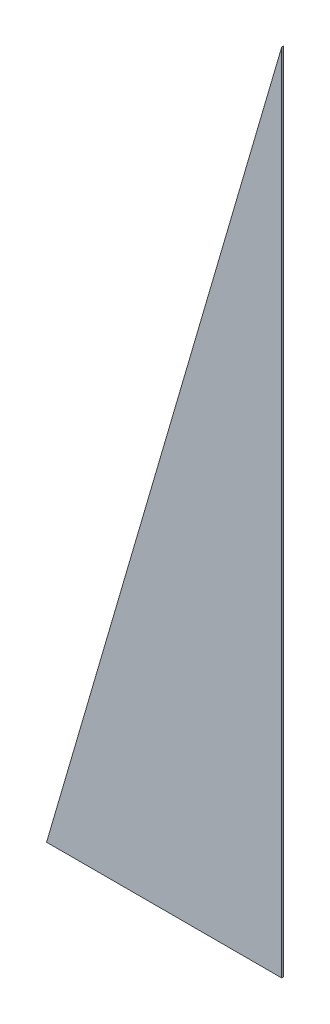
ISO-10303-21;
HEADER;
FILE_DESCRIPTION(('STEP AP214'),'2;1');
FILE_NAME('part.step','',(''),(''),'','','');
FILE_SCHEMA(('AUTOMOTIVE_DESIGN { 1 0 10303 214 1 1 1 1 }'));
ENDSEC;
DATA;
#1=APPLICATION_CONTEXT('core data for automotive mechanical design processes');
#2=APPLICATION_PROTOCOL_DEFINITION('international standard','automotive_design',2000,#1);
#3=PRODUCT_CONTEXT('',#1,'mechanical');
#4=PRODUCT('Part','Part','',(#3));
#5=PRODUCT_RELATED_PRODUCT_CATEGORY('part','',(#4));
#6=PRODUCT_DEFINITION_FORMATION('','',#4);
#7=PRODUCT_DEFINITION_CONTEXT('part definition',#1,'design');
#8=PRODUCT_DEFINITION('design','',#6,#7);
#9=PRODUCT_DEFINITION_SHAPE('','',#8);
#10=(LENGTH_UNIT() NAMED_UNIT(*) SI_UNIT(.MILLI.,.METRE.));
#11=(NAMED_UNIT(*) PLANE_ANGLE_UNIT() SI_UNIT($,.RADIAN.));
#12=(NAMED_UNIT(*) SI_UNIT($,.STERADIAN.) SOLID_ANGLE_UNIT());
#13=UNCERTAINTY_MEASURE_WITH_UNIT(LENGTH_MEASURE(1.E-05),#10,'distance_accuracy_value','');
#14=(GEOMETRIC_REPRESENTATION_CONTEXT(3) GLOBAL_UNCERTAINTY_ASSIGNED_CONTEXT((#13)) GLOBAL_UNIT_ASSIGNED_CONTEXT((#10,
#11,#12)) REPRESENTATION_CONTEXT('',''));
#15=CARTESIAN_POINT('',(0.,0.,0.));
#16=DIRECTION('',(0.,0.,1.));
#17=DIRECTION('',(1.,0.,0.));
#18=AXIS2_PLACEMENT_3D('',#15,#16,#17);
#19=CARTESIAN_POINT('',(-355.6,0.,2.54));
#20=DIRECTION('',(0.,1.,0.));
#21=DIRECTION('',(0.,0.,1.));
#22=AXIS2_PLACEMENT_3D('',#19,#20,#21);
#23=PLANE('',#22);
#24=DIRECTION('',(1.,0.,0.));
#25=VECTOR('',#24,1.);
#26=CARTESIAN_POINT('',(-355.6,0.,0.));
#27=LINE('',#26,#25);
#28=CARTESIAN_POINT('',(-355.6,0.,0.));
#29=VERTEX_POINT('',#28);
#30=CARTESIAN_POINT('',(0.,0.,0.));
#31=VERTEX_POINT('',#30);
#32=EDGE_CURVE('E82',#29,#31,#27,.T.);
#33=ORIENTED_EDGE('',*,*,#32,.T.);
#34=DIRECTION('',(0.,0.,-1.));
#35=VECTOR('',#34,1.);
#36=CARTESIAN_POINT('',(0.,0.,2.54));
#37=LINE('',#36,#35);
#38=CARTESIAN_POINT('',(0.,0.,2.54));
#39=VERTEX_POINT('',#38);
#40=EDGE_CURVE('E11',#39,#31,#37,.T.);
#41=ORIENTED_EDGE('',*,*,#40,.F.);
#42=DIRECTION('',(1.,0.,0.));
#43=VECTOR('',#42,1.);
#44=CARTESIAN_POINT('',(-355.6,0.,2.54));
#45=LINE('',#44,#43);
#46=CARTESIAN_POINT('',(-355.6,0.,2.54));
#47=VERTEX_POINT('',#46);
#48=EDGE_CURVE('E75',#47,#39,#45,.T.);
#49=ORIENTED_EDGE('',*,*,#48,.F.);
#50=DIRECTION('',(0.,0.,-1.));
#51=VECTOR('',#50,1.);
#52=CARTESIAN_POINT('',(-355.6,0.,2.54));
#53=LINE('',#52,#51);
#54=EDGE_CURVE('E83',#47,#29,#53,.T.);
#55=ORIENTED_EDGE('',*,*,#54,.T.);
#56=EDGE_LOOP('',(#33,#41,#49,#55));
#57=FACE_BOUND('',#56,.T.);
#58=ADVANCED_FACE('F35',(#57),#23,.F.);
#59=CARTESIAN_POINT('',(0.,0.,2.54));
#60=DIRECTION('',(-1.,0.,0.));
#61=DIRECTION('',(0.,0.,1.));
#62=AXIS2_PLACEMENT_3D('',#59,#60,#61);
#63=PLANE('',#62);
#64=DIRECTION('',(0.,1.,0.));
#65=VECTOR('',#64,1.);
#66=CARTESIAN_POINT('',(0.,0.,0.));
#67=LINE('',#66,#65);
#68=CARTESIAN_POINT('',(0.,1219.2,0.));
#69=VERTEX_POINT('',#68);
#70=EDGE_CURVE('E63',#31,#69,#67,.T.);
#71=ORIENTED_EDGE('',*,*,#70,.T.);
#72=DIRECTION('',(0.,0.,-1.));
#73=VECTOR('',#72,1.);
#74=CARTESIAN_POINT('',(0.,1219.2,2.54));
#75=LINE('',#74,#73);
#76=CARTESIAN_POINT('',(0.,1219.2,2.54));
#77=VERTEX_POINT('',#76);
#78=EDGE_CURVE('E43',#77,#69,#75,.T.);
#79=ORIENTED_EDGE('',*,*,#78,.F.);
#80=DIRECTION('',(0.,1.,0.));
#81=VECTOR('',#80,1.);
#82=CARTESIAN_POINT('',(0.,0.,2.54));
#83=LINE('',#82,#81);
#84=EDGE_CURVE('E71',#39,#77,#83,.T.);
#85=ORIENTED_EDGE('',*,*,#84,.F.);
#86=ORIENTED_EDGE('',*,*,#40,.T.);
#87=EDGE_LOOP('',(#71,#79,#85,#86));
#88=FACE_BOUND('',#87,.T.);
#89=ADVANCED_FACE('F72',(#88),#63,.F.);
#90=CARTESIAN_POINT('',(0.,1219.2,2.54));
#91=DIRECTION('',(0.96,-0.28,0.));
#92=DIRECTION('',(0.28,0.96,0.));
#93=AXIS2_PLACEMENT_3D('',#90,#91,#92);
#94=PLANE('',#93);
#95=DIRECTION('',(-0.28,-0.96,0.));
#96=VECTOR('',#95,1.);
#97=CARTESIAN_POINT('',(0.,1219.2,0.));
#98=LINE('',#97,#96);
#99=EDGE_CURVE('E68',#69,#29,#98,.T.);
#100=ORIENTED_EDGE('',*,*,#99,.T.);
#101=ORIENTED_EDGE('',*,*,#54,.F.);
#102=DIRECTION('',(-0.28,-0.96,0.));
#103=VECTOR('',#102,1.);
#104=CARTESIAN_POINT('',(0.,1219.2,2.54));
#105=LINE('',#104,#103);
#106=EDGE_CURVE('E51',#77,#47,#105,.T.);
#107=ORIENTED_EDGE('',*,*,#106,.F.);
#108=ORIENTED_EDGE('',*,*,#78,.T.);
#109=EDGE_LOOP('',(#100,#101,#107,#108));
#110=FACE_BOUND('',#109,.T.);
#111=ADVANCED_FACE('F90',(#110),#94,.F.);
#112=CARTESIAN_POINT('',(0.,0.,2.54));
#113=DIRECTION('',(0.,0.,1.));
#114=DIRECTION('',(1.,0.,0.));
#115=AXIS2_PLACEMENT_3D('',#112,#113,#114);
#116=PLANE('',#115);
#117=ORIENTED_EDGE('',*,*,#48,.T.);
#118=ORIENTED_EDGE('',*,*,#84,.T.);
#119=ORIENTED_EDGE('',*,*,#106,.T.);
#120=EDGE_LOOP('',(#117,#118,#119));
#121=FACE_BOUND('',#120,.T.);
#122=ADVANCED_FACE('F78',(#121),#116,.T.);
#123=CARTESIAN_POINT('',(0.,0.,0.));
#124=DIRECTION('',(0.,0.,1.));
#125=DIRECTION('',(1.,0.,0.));
#126=AXIS2_PLACEMENT_3D('',#123,#124,#125);
#127=PLANE('',#126);
#128=ORIENTED_EDGE('',*,*,#32,.F.);
#129=ORIENTED_EDGE('',*,*,#99,.F.);
#130=ORIENTED_EDGE('',*,*,#70,.F.);
#131=EDGE_LOOP('',(#128,#129,#130));
#132=FACE_BOUND('',#131,.T.);
#133=ADVANCED_FACE('F91',(#132),#127,.F.);
#134=CLOSED_SHELL('',(#58,#89,#111,#122,#133));
#135=MANIFOLD_SOLID_BREP('B2',#134);
#136=ADVANCED_BREP_SHAPE_REPRESENTATION('',(#18,#135),#14);
#137=SHAPE_DEFINITION_REPRESENTATION(#9,#136);
ENDSEC;
END-ISO-10303-21;
